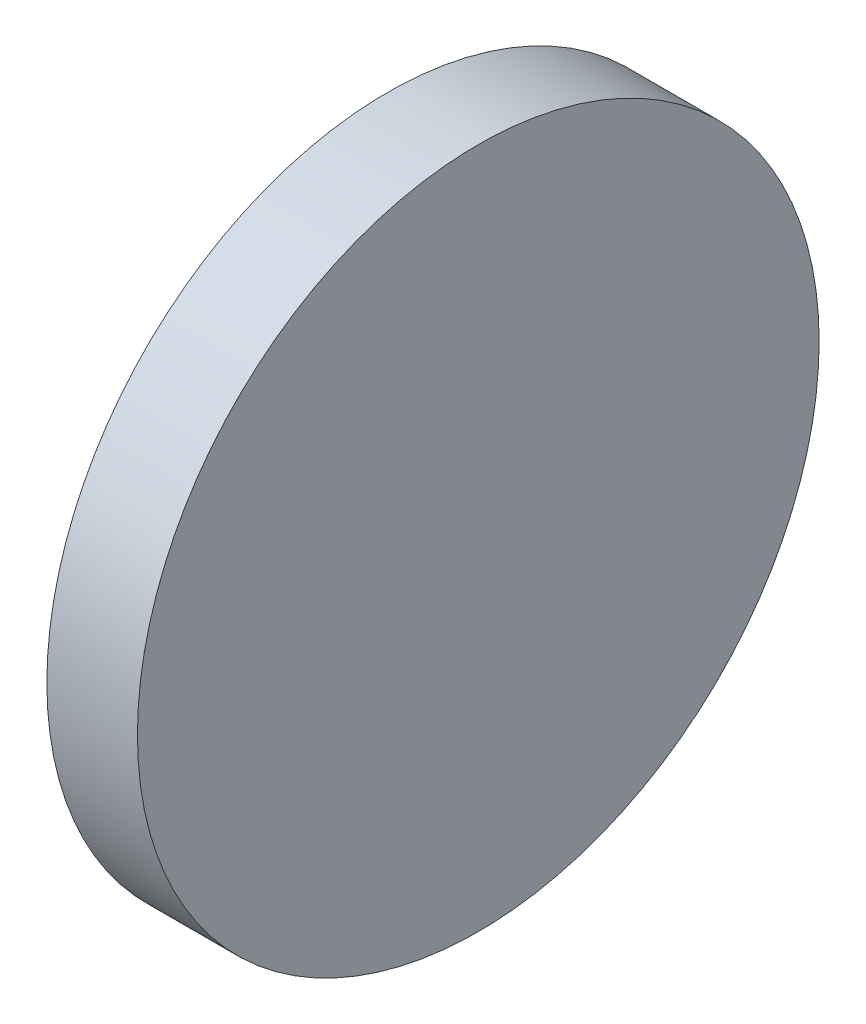
ISO-10303-21;
HEADER;
FILE_DESCRIPTION(('STEP AP214'),'2;1');
FILE_NAME('part.step','',(''),(''),'','','');
FILE_SCHEMA(('AUTOMOTIVE_DESIGN { 1 0 10303 214 1 1 1 1 }'));
ENDSEC;
DATA;
#1=APPLICATION_CONTEXT('core data for automotive mechanical design processes');
#2=APPLICATION_PROTOCOL_DEFINITION('international standard','automotive_design',2000,#1);
#3=PRODUCT_CONTEXT('',#1,'mechanical');
#4=PRODUCT('Part','Part','',(#3));
#5=PRODUCT_RELATED_PRODUCT_CATEGORY('part','',(#4));
#6=PRODUCT_DEFINITION_FORMATION('','',#4);
#7=PRODUCT_DEFINITION_CONTEXT('part definition',#1,'design');
#8=PRODUCT_DEFINITION('design','',#6,#7);
#9=PRODUCT_DEFINITION_SHAPE('','',#8);
#10=(LENGTH_UNIT() NAMED_UNIT(*) SI_UNIT(.MILLI.,.METRE.));
#11=(NAMED_UNIT(*) PLANE_ANGLE_UNIT() SI_UNIT($,.RADIAN.));
#12=(NAMED_UNIT(*) SI_UNIT($,.STERADIAN.) SOLID_ANGLE_UNIT());
#13=UNCERTAINTY_MEASURE_WITH_UNIT(LENGTH_MEASURE(1.E-05),#10,'distance_accuracy_value','');
#14=(GEOMETRIC_REPRESENTATION_CONTEXT(3) GLOBAL_UNCERTAINTY_ASSIGNED_CONTEXT((#13)) GLOBAL_UNIT_ASSIGNED_CONTEXT((#10,
#11,#12)) REPRESENTATION_CONTEXT('',''));
#15=CARTESIAN_POINT('',(0.,0.,0.));
#16=DIRECTION('',(0.,0.,1.));
#17=DIRECTION('',(1.,0.,0.));
#18=AXIS2_PLACEMENT_3D('',#15,#16,#17);
#19=CARTESIAN_POINT('',(-138.2329779404,-264.839472606,-187.2691477876));
#20=DIRECTION('',(-1.,0.,0.));
#21=DIRECTION('',(0.,0.,1.));
#22=AXIS2_PLACEMENT_3D('',#19,#20,#21);
#23=PLANE('',#22);
#24=CARTESIAN_POINT('',(-138.2329779404,-217.671164606,-140.1008397876));
#25=DIRECTION('',(1.,0.,0.));
#26=DIRECTION('',(0.,0.,-1.));
#27=AXIS2_PLACEMENT_3D('',#24,#25,#26);
#28=CIRCLE('',#27,46.609);
#29=CARTESIAN_POINT('',(-138.2329779404,-217.671164606,-186.7098397876));
#30=VERTEX_POINT('',#29);
#31=EDGE_CURVE('E19',#30,#30,#28,.T.);
#32=ORIENTED_EDGE('',*,*,#31,.T.);
#33=EDGE_LOOP('',(#32));
#34=FACE_BOUND('',#33,.T.);
#35=ADVANCED_FACE('F15',(#34),#23,.F.);
#36=CARTESIAN_POINT('',(-150.6154779404,-264.839472606,-187.2691477876));
#37=DIRECTION('',(-1.,0.,0.));
#38=DIRECTION('',(0.,0.,1.));
#39=AXIS2_PLACEMENT_3D('',#36,#37,#38);
#40=PLANE('',#39);
#41=CARTESIAN_POINT('',(-150.6154779404,-217.671164606,-140.1008397876));
#42=DIRECTION('',(1.,0.,0.));
#43=DIRECTION('',(0.,0.,-1.));
#44=AXIS2_PLACEMENT_3D('',#41,#42,#43);
#45=CIRCLE('',#44,46.609);
#46=CARTESIAN_POINT('',(-150.6154779404,-217.671164606,-186.7098397876));
#47=VERTEX_POINT('',#46);
#48=EDGE_CURVE('E10',#47,#47,#45,.F.);
#49=ORIENTED_EDGE('',*,*,#48,.T.);
#50=EDGE_LOOP('',(#49));
#51=FACE_BOUND('',#50,.T.);
#52=ADVANCED_FACE('F17',(#51),#40,.T.);
#53=CARTESIAN_POINT('',(-150.6154779404,-217.671164606,-140.1008397876));
#54=DIRECTION('',(1.,0.,0.));
#55=DIRECTION('',(0.,0.,-1.));
#56=AXIS2_PLACEMENT_3D('',#53,#54,#55);
#57=CYLINDRICAL_SURFACE('',#56,46.609);
#58=ORIENTED_EDGE('',*,*,#31,.F.);
#59=EDGE_LOOP('',(#58));
#60=FACE_BOUND('',#59,.T.);
#61=ORIENTED_EDGE('',*,*,#48,.F.);
#62=EDGE_LOOP('',(#61));
#63=FACE_BOUND('',#62,.T.);
#64=ADVANCED_FACE('F29',(#60,#63),#57,.T.);
#65=CLOSED_SHELL('',(#35,#52,#64));
#66=MANIFOLD_SOLID_BREP('B1',#65);
#67=ADVANCED_BREP_SHAPE_REPRESENTATION('',(#18,#66),#14);
#68=SHAPE_DEFINITION_REPRESENTATION(#9,#67);
ENDSEC;
END-ISO-10303-21;
